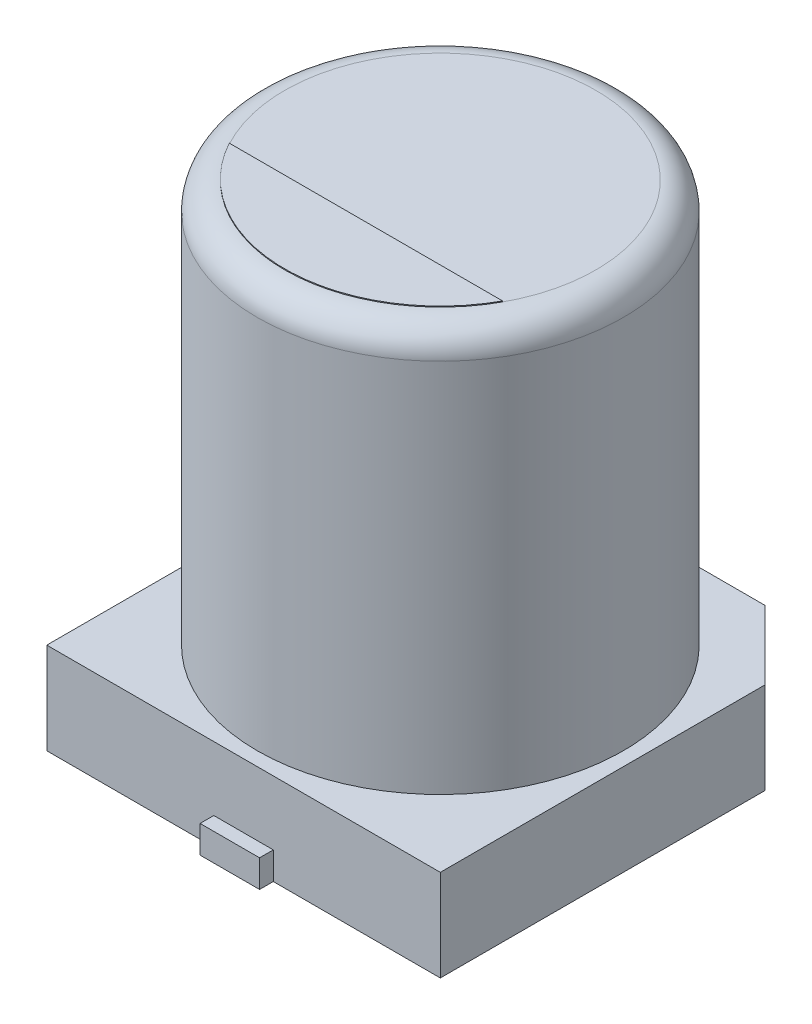
ISO-10303-21;
HEADER;
FILE_DESCRIPTION(('STEP AP214'),'2;1');
FILE_NAME('part.step','',(''),(''),'','','');
FILE_SCHEMA(('AUTOMOTIVE_DESIGN { 1 0 10303 214 1 1 1 1 }'));
ENDSEC;
DATA;
#1=APPLICATION_CONTEXT('core data for automotive mechanical design processes');
#2=APPLICATION_PROTOCOL_DEFINITION('international standard','automotive_design',2000,#1);
#3=PRODUCT_CONTEXT('',#1,'mechanical');
#4=PRODUCT('Part','Part','',(#3));
#5=PRODUCT_RELATED_PRODUCT_CATEGORY('part','',(#4));
#6=PRODUCT_DEFINITION_FORMATION('','',#4);
#7=PRODUCT_DEFINITION_CONTEXT('part definition',#1,'design');
#8=PRODUCT_DEFINITION('design','',#6,#7);
#9=PRODUCT_DEFINITION_SHAPE('','',#8);
#10=(LENGTH_UNIT() NAMED_UNIT(*) SI_UNIT(.MILLI.,.METRE.));
#11=(NAMED_UNIT(*) PLANE_ANGLE_UNIT() SI_UNIT($,.RADIAN.));
#12=(NAMED_UNIT(*) SI_UNIT($,.STERADIAN.) SOLID_ANGLE_UNIT());
#13=UNCERTAINTY_MEASURE_WITH_UNIT(LENGTH_MEASURE(1.E-05),#10,'distance_accuracy_value','');
#14=(GEOMETRIC_REPRESENTATION_CONTEXT(3) GLOBAL_UNCERTAINTY_ASSIGNED_CONTEXT((#13)) GLOBAL_UNIT_ASSIGNED_CONTEXT((#10,
#11,#12)) REPRESENTATION_CONTEXT('',''));
#15=CARTESIAN_POINT('',(0.,0.,0.));
#16=DIRECTION('',(0.,0.,1.));
#17=DIRECTION('',(1.,0.,0.));
#18=AXIS2_PLACEMENT_3D('',#15,#16,#17);
#19=CARTESIAN_POINT('',(0.,5.4,0.));
#20=DIRECTION('',(0.,1.,0.));
#21=DIRECTION('',(0.,0.,1.));
#22=AXIS2_PLACEMENT_3D('',#19,#20,#21);
#23=PLANE('',#22);
#24=CARTESIAN_POINT('',(0.,5.4,0.));
#25=DIRECTION('',(0.,1.,0.));
#26=DIRECTION('',(0.,0.,1.));
#27=AXIS2_PLACEMENT_3D('',#24,#25,#26);
#28=CIRCLE('',#27,1.7);
#29=CARTESIAN_POINT('',(1.49303756103946,5.4,0.812919947673408));
#30=VERTEX_POINT('',#29);
#31=CARTESIAN_POINT('',(-1.49303756103946,5.4,0.812919947673408));
#32=VERTEX_POINT('',#31);
#33=EDGE_CURVE('E221',#30,#32,#28,.T.);
#34=ORIENTED_EDGE('',*,*,#33,.T.);
#35=DIRECTION('',(-1.,0.,0.));
#36=VECTOR('',#35,1.);
#37=CARTESIAN_POINT('',(1.49303756103946,5.4,0.812919947673408));
#38=LINE('',#37,#36);
#39=EDGE_CURVE('E159',#30,#32,#38,.T.);
#40=ORIENTED_EDGE('',*,*,#39,.F.);
#41=EDGE_LOOP('',(#34,#40));
#42=FACE_BOUND('',#41,.T.);
#43=ADVANCED_FACE('F33',(#42),#23,.T.);
#44=CARTESIAN_POINT('',(-1.4,1.,-2.15));
#45=DIRECTION('',(0.,0.,1.));
#46=DIRECTION('',(1.,0.,0.));
#47=AXIS2_PLACEMENT_3D('',#44,#45,#46);
#48=PLANE('',#47);
#49=DIRECTION('',(0.,-1.,0.));
#50=VECTOR('',#49,1.);
#51=CARTESIAN_POINT('',(0.325,1.,-2.15));
#52=LINE('',#51,#50);
#53=CARTESIAN_POINT('',(0.325,0.3,-2.15));
#54=VERTEX_POINT('',#53);
#55=CARTESIAN_POINT('',(0.325,0.,-2.15));
#56=VERTEX_POINT('',#55);
#57=EDGE_CURVE('E188',#54,#56,#52,.T.);
#58=ORIENTED_EDGE('',*,*,#57,.F.);
#59=DIRECTION('',(-1.,0.,0.));
#60=VECTOR('',#59,1.);
#61=CARTESIAN_POINT('',(-1.4,0.3,-2.15));
#62=LINE('',#61,#60);
#63=CARTESIAN_POINT('',(-0.325,0.3,-2.15));
#64=VERTEX_POINT('',#63);
#65=EDGE_CURVE('E11',#54,#64,#62,.T.);
#66=ORIENTED_EDGE('',*,*,#65,.T.);
#67=DIRECTION('',(0.,1.,0.));
#68=VECTOR('',#67,1.);
#69=CARTESIAN_POINT('',(-0.325,1.,-2.15));
#70=LINE('',#69,#68);
#71=CARTESIAN_POINT('',(-0.325,0.,-2.15));
#72=VERTEX_POINT('',#71);
#73=EDGE_CURVE('E186',#72,#64,#70,.T.);
#74=ORIENTED_EDGE('',*,*,#73,.F.);
#75=DIRECTION('',(-1.,0.,0.));
#76=VECTOR('',#75,1.);
#77=CARTESIAN_POINT('',(-1.4,0.,-2.15));
#78=LINE('',#77,#76);
#79=CARTESIAN_POINT('',(-1.4,0.,-2.15));
#80=VERTEX_POINT('',#79);
#81=EDGE_CURVE('E242',#72,#80,#78,.T.);
#82=ORIENTED_EDGE('',*,*,#81,.T.);
#83=DIRECTION('',(0.,-1.,0.));
#84=VECTOR('',#83,1.);
#85=CARTESIAN_POINT('',(-1.4,1.,-2.15));
#86=LINE('',#85,#84);
#87=CARTESIAN_POINT('',(-1.4,1.,-2.15));
#88=VERTEX_POINT('',#87);
#89=EDGE_CURVE('E259',#88,#80,#86,.T.);
#90=ORIENTED_EDGE('',*,*,#89,.F.);
#91=DIRECTION('',(-1.,0.,0.));
#92=VECTOR('',#91,1.);
#93=CARTESIAN_POINT('',(-1.4,1.,-2.15));
#94=LINE('',#93,#92);
#95=CARTESIAN_POINT('',(1.4,1.,-2.15));
#96=VERTEX_POINT('',#95);
#97=EDGE_CURVE('E229',#96,#88,#94,.T.);
#98=ORIENTED_EDGE('',*,*,#97,.F.);
#99=DIRECTION('',(0.,-1.,0.));
#100=VECTOR('',#99,1.);
#101=CARTESIAN_POINT('',(1.4,1.,-2.15));
#102=LINE('',#101,#100);
#103=CARTESIAN_POINT('',(1.4,0.,-2.15));
#104=VERTEX_POINT('',#103);
#105=EDGE_CURVE('E262',#96,#104,#102,.T.);
#106=ORIENTED_EDGE('',*,*,#105,.T.);
#107=EDGE_CURVE('E243',#104,#56,#78,.T.);
#108=ORIENTED_EDGE('',*,*,#107,.T.);
#109=EDGE_LOOP('',(#58,#66,#74,#82,#90,#98,#106,#108));
#110=FACE_BOUND('',#109,.T.);
#111=ADVANCED_FACE('F319',(#110),#48,.F.);
#112=CARTESIAN_POINT('',(2.15,1.,2.15));
#113=DIRECTION('',(0.,0.,-1.));
#114=DIRECTION('',(-1.,0.,0.));
#115=AXIS2_PLACEMENT_3D('',#112,#113,#114);
#116=PLANE('',#115);
#117=DIRECTION('',(0.,-1.,0.));
#118=VECTOR('',#117,1.);
#119=CARTESIAN_POINT('',(-0.325,1.,2.15));
#120=LINE('',#119,#118);
#121=CARTESIAN_POINT('',(-0.325,0.3,2.15));
#122=VERTEX_POINT('',#121);
#123=CARTESIAN_POINT('',(-0.324999999999999,0.,2.15));
#124=VERTEX_POINT('',#123);
#125=EDGE_CURVE('E214',#122,#124,#120,.T.);
#126=ORIENTED_EDGE('',*,*,#125,.F.);
#127=DIRECTION('',(-1.,0.,0.));
#128=VECTOR('',#127,1.);
#129=CARTESIAN_POINT('',(2.15,0.3,2.15));
#130=LINE('',#129,#128);
#131=CARTESIAN_POINT('',(0.325,0.3,2.15));
#132=VERTEX_POINT('',#131);
#133=EDGE_CURVE('E41',#132,#122,#130,.T.);
#134=ORIENTED_EDGE('',*,*,#133,.F.);
#135=DIRECTION('',(0.,1.,0.));
#136=VECTOR('',#135,1.);
#137=CARTESIAN_POINT('',(0.325,1.,2.15));
#138=LINE('',#137,#136);
#139=CARTESIAN_POINT('',(0.325,0.,2.15));
#140=VERTEX_POINT('',#139);
#141=EDGE_CURVE('E211',#140,#132,#138,.T.);
#142=ORIENTED_EDGE('',*,*,#141,.F.);
#143=DIRECTION('',(1.,0.,0.));
#144=VECTOR('',#143,1.);
#145=CARTESIAN_POINT('',(2.15,0.,2.15));
#146=LINE('',#145,#144);
#147=CARTESIAN_POINT('',(2.15,0.,2.15));
#148=VERTEX_POINT('',#147);
#149=EDGE_CURVE('E249',#140,#148,#146,.T.);
#150=ORIENTED_EDGE('',*,*,#149,.T.);
#151=DIRECTION('',(0.,-1.,0.));
#152=VECTOR('',#151,1.);
#153=CARTESIAN_POINT('',(2.15,1.,2.15));
#154=LINE('',#153,#152);
#155=CARTESIAN_POINT('',(2.15,1.,2.15));
#156=VERTEX_POINT('',#155);
#157=EDGE_CURVE('E237',#156,#148,#154,.T.);
#158=ORIENTED_EDGE('',*,*,#157,.F.);
#159=DIRECTION('',(1.,0.,0.));
#160=VECTOR('',#159,1.);
#161=CARTESIAN_POINT('',(2.15,1.,2.15));
#162=LINE('',#161,#160);
#163=CARTESIAN_POINT('',(-2.15,1.,2.15));
#164=VERTEX_POINT('',#163);
#165=EDGE_CURVE('E235',#164,#156,#162,.T.);
#166=ORIENTED_EDGE('',*,*,#165,.F.);
#167=DIRECTION('',(0.,-1.,0.));
#168=VECTOR('',#167,1.);
#169=CARTESIAN_POINT('',(-2.15,1.,2.15));
#170=LINE('',#169,#168);
#171=CARTESIAN_POINT('',(-2.15,0.,2.15));
#172=VERTEX_POINT('',#171);
#173=EDGE_CURVE('E253',#164,#172,#170,.T.);
#174=ORIENTED_EDGE('',*,*,#173,.T.);
#175=EDGE_CURVE('E227',#172,#124,#146,.T.);
#176=ORIENTED_EDGE('',*,*,#175,.T.);
#177=EDGE_LOOP('',(#126,#134,#142,#150,#158,#166,#174,#176));
#178=FACE_BOUND('',#177,.T.);
#179=ADVANCED_FACE('F289',(#178),#116,.F.);
#180=CARTESIAN_POINT('',(2.15,1.,-1.4));
#181=DIRECTION('',(-1.,0.,0.));
#182=DIRECTION('',(0.,0.,1.));
#183=AXIS2_PLACEMENT_3D('',#180,#181,#182);
#184=PLANE('',#183);
#185=DIRECTION('',(0.,0.,-1.));
#186=VECTOR('',#185,1.);
#187=CARTESIAN_POINT('',(2.15,0.,-1.4));
#188=LINE('',#187,#186);
#189=CARTESIAN_POINT('',(2.15,0.,-1.4));
#190=VERTEX_POINT('',#189);
#191=EDGE_CURVE('E217',#148,#190,#188,.T.);
#192=ORIENTED_EDGE('',*,*,#191,.T.);
#193=DIRECTION('',(0.,-1.,0.));
#194=VECTOR('',#193,1.);
#195=CARTESIAN_POINT('',(2.15,1.,-1.4));
#196=LINE('',#195,#194);
#197=CARTESIAN_POINT('',(2.15,1.,-1.4));
#198=VERTEX_POINT('',#197);
#199=EDGE_CURVE('E222',#198,#190,#196,.T.);
#200=ORIENTED_EDGE('',*,*,#199,.F.);
#201=DIRECTION('',(0.,0.,-1.));
#202=VECTOR('',#201,1.);
#203=CARTESIAN_POINT('',(2.15,1.,-1.4));
#204=LINE('',#203,#202);
#205=EDGE_CURVE('E223',#156,#198,#204,.T.);
#206=ORIENTED_EDGE('',*,*,#205,.F.);
#207=ORIENTED_EDGE('',*,*,#157,.T.);
#208=EDGE_LOOP('',(#192,#200,#206,#207));
#209=FACE_BOUND('',#208,.T.);
#210=ADVANCED_FACE('F296',(#209),#184,.F.);
#211=CARTESIAN_POINT('',(1.4,1.,-2.15));
#212=DIRECTION('',(-0.707106781186547,0.,0.707106781186548));
#213=DIRECTION('',(0.707106781186548,0.,0.707106781186547));
#214=AXIS2_PLACEMENT_3D('',#211,#212,#213);
#215=PLANE('',#214);
#216=DIRECTION('',(-0.707106781186548,0.,-0.707106781186547));
#217=VECTOR('',#216,1.);
#218=CARTESIAN_POINT('',(1.4,0.,-2.15));
#219=LINE('',#218,#217);
#220=EDGE_CURVE('E240',#190,#104,#219,.T.);
#221=ORIENTED_EDGE('',*,*,#220,.T.);
#222=ORIENTED_EDGE('',*,*,#105,.F.);
#223=DIRECTION('',(-0.707106781186548,0.,-0.707106781186547));
#224=VECTOR('',#223,1.);
#225=CARTESIAN_POINT('',(1.4,1.,-2.15));
#226=LINE('',#225,#224);
#227=EDGE_CURVE('E226',#198,#96,#226,.T.);
#228=ORIENTED_EDGE('',*,*,#227,.F.);
#229=ORIENTED_EDGE('',*,*,#199,.T.);
#230=EDGE_LOOP('',(#221,#222,#228,#229));
#231=FACE_BOUND('',#230,.T.);
#232=ADVANCED_FACE('F303',(#231),#215,.F.);
#233=CARTESIAN_POINT('',(-2.15,1.,-1.4));
#234=DIRECTION('',(0.707106781186547,0.,0.707106781186548));
#235=DIRECTION('',(0.707106781186548,0.,-0.707106781186547));
#236=AXIS2_PLACEMENT_3D('',#233,#234,#235);
#237=PLANE('',#236);
#238=DIRECTION('',(-0.707106781186548,0.,0.707106781186547));
#239=VECTOR('',#238,1.);
#240=CARTESIAN_POINT('',(-2.15,0.,-1.4));
#241=LINE('',#240,#239);
#242=CARTESIAN_POINT('',(-2.15,0.,-1.4));
#243=VERTEX_POINT('',#242);
#244=EDGE_CURVE('E245',#80,#243,#241,.T.);
#245=ORIENTED_EDGE('',*,*,#244,.T.);
#246=DIRECTION('',(0.,-1.,0.));
#247=VECTOR('',#246,1.);
#248=CARTESIAN_POINT('',(-2.15,1.,-1.4));
#249=LINE('',#248,#247);
#250=CARTESIAN_POINT('',(-2.15,1.,-1.4));
#251=VERTEX_POINT('',#250);
#252=EDGE_CURVE('E256',#251,#243,#249,.T.);
#253=ORIENTED_EDGE('',*,*,#252,.F.);
#254=DIRECTION('',(-0.707106781186548,0.,0.707106781186547));
#255=VECTOR('',#254,1.);
#256=CARTESIAN_POINT('',(-2.15,1.,-1.4));
#257=LINE('',#256,#255);
#258=EDGE_CURVE('E231',#88,#251,#257,.T.);
#259=ORIENTED_EDGE('',*,*,#258,.F.);
#260=ORIENTED_EDGE('',*,*,#89,.T.);
#261=EDGE_LOOP('',(#245,#253,#259,#260));
#262=FACE_BOUND('',#261,.T.);
#263=ADVANCED_FACE('F317',(#262),#237,.F.);
#264=CARTESIAN_POINT('',(-2.15,1.,2.15));
#265=DIRECTION('',(1.,0.,0.));
#266=DIRECTION('',(0.,0.,-1.));
#267=AXIS2_PLACEMENT_3D('',#264,#265,#266);
#268=PLANE('',#267);
#269=DIRECTION('',(0.,0.,1.));
#270=VECTOR('',#269,1.);
#271=CARTESIAN_POINT('',(-2.15,0.,2.15));
#272=LINE('',#271,#270);
#273=EDGE_CURVE('E247',#243,#172,#272,.T.);
#274=ORIENTED_EDGE('',*,*,#273,.T.);
#275=ORIENTED_EDGE('',*,*,#173,.F.);
#276=DIRECTION('',(0.,0.,1.));
#277=VECTOR('',#276,1.);
#278=CARTESIAN_POINT('',(-2.15,1.,2.15));
#279=LINE('',#278,#277);
#280=EDGE_CURVE('E233',#251,#164,#279,.T.);
#281=ORIENTED_EDGE('',*,*,#280,.F.);
#282=ORIENTED_EDGE('',*,*,#252,.T.);
#283=EDGE_LOOP('',(#274,#275,#281,#282));
#284=FACE_BOUND('',#283,.T.);
#285=ADVANCED_FACE('F313',(#284),#268,.F.);
#286=CARTESIAN_POINT('',(0.,1.,0.));
#287=DIRECTION('',(0.,-1.,0.));
#288=DIRECTION('',(0.,0.,-1.));
#289=AXIS2_PLACEMENT_3D('',#286,#287,#288);
#290=PLANE('',#289);
#291=CARTESIAN_POINT('',(0.,1.,0.));
#292=DIRECTION('',(0.,-1.,0.));
#293=DIRECTION('',(0.,0.,-1.));
#294=AXIS2_PLACEMENT_3D('',#291,#292,#293);
#295=CIRCLE('',#294,2.);
#296=CARTESIAN_POINT('',(0.,1.,-2.));
#297=VERTEX_POINT('',#296);
#298=EDGE_CURVE('E218',#297,#297,#295,.F.);
#299=ORIENTED_EDGE('',*,*,#298,.F.);
#300=EDGE_LOOP('',(#299));
#301=FACE_BOUND('',#300,.T.);
#302=ORIENTED_EDGE('',*,*,#205,.T.);
#303=ORIENTED_EDGE('',*,*,#227,.T.);
#304=ORIENTED_EDGE('',*,*,#97,.T.);
#305=ORIENTED_EDGE('',*,*,#258,.T.);
#306=ORIENTED_EDGE('',*,*,#280,.T.);
#307=ORIENTED_EDGE('',*,*,#165,.T.);
#308=EDGE_LOOP('',(#302,#303,#304,#305,#306,#307));
#309=FACE_BOUND('',#308,.T.);
#310=ADVANCED_FACE('F306',(#301,#309),#290,.F.);
#311=CARTESIAN_POINT('',(0.,0.,0.));
#312=DIRECTION('',(0.,-1.,0.));
#313=DIRECTION('',(0.,0.,-1.));
#314=AXIS2_PLACEMENT_3D('',#311,#312,#313);
#315=PLANE('',#314);
#316=ORIENTED_EDGE('',*,*,#81,.F.);
#317=DIRECTION('',(0.,0.,1.));
#318=VECTOR('',#317,1.);
#319=CARTESIAN_POINT('',(-0.325,0.,-0.5));
#320=LINE('',#319,#318);
#321=CARTESIAN_POINT('',(-0.325,0.,-2.3));
#322=VERTEX_POINT('',#321);
#323=EDGE_CURVE('E172',#322,#72,#320,.T.);
#324=ORIENTED_EDGE('',*,*,#323,.F.);
#325=DIRECTION('',(-1.,0.,0.));
#326=VECTOR('',#325,1.);
#327=CARTESIAN_POINT('',(0.325,0.,-2.3));
#328=LINE('',#327,#326);
#329=CARTESIAN_POINT('',(0.325,0.,-2.3));
#330=VERTEX_POINT('',#329);
#331=EDGE_CURVE('E164',#330,#322,#328,.T.);
#332=ORIENTED_EDGE('',*,*,#331,.F.);
#333=DIRECTION('',(0.,0.,-1.));
#334=VECTOR('',#333,1.);
#335=CARTESIAN_POINT('',(0.325,0.,-0.5));
#336=LINE('',#335,#334);
#337=EDGE_CURVE('E162',#56,#330,#336,.T.);
#338=ORIENTED_EDGE('',*,*,#337,.F.);
#339=ORIENTED_EDGE('',*,*,#107,.F.);
#340=ORIENTED_EDGE('',*,*,#220,.F.);
#341=ORIENTED_EDGE('',*,*,#191,.F.);
#342=ORIENTED_EDGE('',*,*,#149,.F.);
#343=DIRECTION('',(0.,0.,-1.));
#344=VECTOR('',#343,1.);
#345=CARTESIAN_POINT('',(0.325,0.,0.5));
#346=LINE('',#345,#344);
#347=CARTESIAN_POINT('',(0.325,0.,2.3));
#348=VERTEX_POINT('',#347);
#349=EDGE_CURVE('E195',#348,#140,#346,.T.);
#350=ORIENTED_EDGE('',*,*,#349,.F.);
#351=DIRECTION('',(1.,0.,0.));
#352=VECTOR('',#351,1.);
#353=CARTESIAN_POINT('',(0.325,0.,2.3));
#354=LINE('',#353,#352);
#355=CARTESIAN_POINT('',(-0.325,0.,2.3));
#356=VERTEX_POINT('',#355);
#357=EDGE_CURVE('E202',#356,#348,#354,.T.);
#358=ORIENTED_EDGE('',*,*,#357,.F.);
#359=DIRECTION('',(0.,0.,1.));
#360=VECTOR('',#359,1.);
#361=CARTESIAN_POINT('',(-0.325,0.,0.5));
#362=LINE('',#361,#360);
#363=EDGE_CURVE('E191',#124,#356,#362,.T.);
#364=ORIENTED_EDGE('',*,*,#363,.F.);
#365=ORIENTED_EDGE('',*,*,#175,.F.);
#366=ORIENTED_EDGE('',*,*,#273,.F.);
#367=ORIENTED_EDGE('',*,*,#244,.F.);
#368=EDGE_LOOP('',(#316,#324,#332,#338,#339,#340,#341,#342,#350,#358,#364,#365,#366,#367));
#369=FACE_BOUND('',#368,.T.);
#370=ADVANCED_FACE('F298',(#369),#315,.T.);
#371=CARTESIAN_POINT('',(0.,5.4,0.));
#372=DIRECTION('',(0.,-1.,0.));
#373=DIRECTION('',(0.,0.,-1.));
#374=AXIS2_PLACEMENT_3D('',#371,#372,#373);
#375=CYLINDRICAL_SURFACE('',#374,2.);
#376=CARTESIAN_POINT('',(0.,5.1,0.));
#377=DIRECTION('',(0.,1.,0.));
#378=DIRECTION('',(0.,0.,1.));
#379=AXIS2_PLACEMENT_3D('',#376,#377,#378);
#380=CIRCLE('',#379,2.);
#381=CARTESIAN_POINT('',(0.,5.1,2.));
#382=VERTEX_POINT('',#381);
#383=EDGE_CURVE('E268',#382,#382,#380,.F.);
#384=ORIENTED_EDGE('',*,*,#383,.T.);
#385=EDGE_LOOP('',(#384));
#386=FACE_BOUND('',#385,.T.);
#387=ORIENTED_EDGE('',*,*,#298,.T.);
#388=EDGE_LOOP('',(#387));
#389=FACE_BOUND('',#388,.T.);
#390=ADVANCED_FACE('F354',(#386,#389),#375,.T.);
#391=CARTESIAN_POINT('',(0.,5.1,0.));
#392=DIRECTION('',(0.,1.,0.));
#393=DIRECTION('',(0.,0.,1.));
#394=AXIS2_PLACEMENT_3D('',#391,#392,#393);
#395=TOROIDAL_SURFACE('',#394,1.7,0.3);
#396=ORIENTED_EDGE('',*,*,#383,.F.);
#397=EDGE_LOOP('',(#396));
#398=FACE_BOUND('',#397,.T.);
#399=ORIENTED_EDGE('',*,*,#33,.F.);
#400=CARTESIAN_POINT('',(0.,5.4,0.));
#401=DIRECTION('',(0.,1.,0.));
#402=DIRECTION('',(0.,0.,-1.));
#403=AXIS2_PLACEMENT_3D('',#400,#401,#402);
#404=CIRCLE('',#403,1.7);
#405=EDGE_CURVE('E47',#32,#30,#404,.T.);
#406=ORIENTED_EDGE('',*,*,#405,.F.);
#407=EDGE_LOOP('',(#399,#406));
#408=FACE_BOUND('',#407,.T.);
#409=ADVANCED_FACE('F35',(#398,#408),#395,.T.);
#410=CARTESIAN_POINT('',(0.,0.3,0.));
#411=DIRECTION('',(0.,-1.,0.));
#412=DIRECTION('',(0.,0.,-1.));
#413=AXIS2_PLACEMENT_3D('',#410,#411,#412);
#414=PLANE('',#413);
#415=DIRECTION('',(0.,0.,-1.));
#416=VECTOR('',#415,1.);
#417=CARTESIAN_POINT('',(0.325,0.3,0.5));
#418=LINE('',#417,#416);
#419=CARTESIAN_POINT('',(0.325,0.3,2.3));
#420=VERTEX_POINT('',#419);
#421=EDGE_CURVE('E197',#420,#132,#418,.T.);
#422=ORIENTED_EDGE('',*,*,#421,.T.);
#423=ORIENTED_EDGE('',*,*,#133,.T.);
#424=DIRECTION('',(0.,0.,1.));
#425=VECTOR('',#424,1.);
#426=CARTESIAN_POINT('',(-0.325,0.3,0.5));
#427=LINE('',#426,#425);
#428=CARTESIAN_POINT('',(-0.325,0.3,2.3));
#429=VERTEX_POINT('',#428);
#430=EDGE_CURVE('E192',#122,#429,#427,.T.);
#431=ORIENTED_EDGE('',*,*,#430,.T.);
#432=DIRECTION('',(1.,0.,0.));
#433=VECTOR('',#432,1.);
#434=CARTESIAN_POINT('',(0.325,0.3,2.3));
#435=LINE('',#434,#433);
#436=EDGE_CURVE('E194',#429,#420,#435,.T.);
#437=ORIENTED_EDGE('',*,*,#436,.T.);
#438=EDGE_LOOP('',(#422,#423,#431,#437));
#439=FACE_BOUND('',#438,.T.);
#440=ADVANCED_FACE('F273',(#439),#414,.F.);
#441=CARTESIAN_POINT('',(-0.325,0.3,0.5));
#442=DIRECTION('',(1.,0.,0.));
#443=DIRECTION('',(0.,0.,-1.));
#444=AXIS2_PLACEMENT_3D('',#441,#442,#443);
#445=PLANE('',#444);
#446=ORIENTED_EDGE('',*,*,#430,.F.);
#447=ORIENTED_EDGE('',*,*,#125,.T.);
#448=ORIENTED_EDGE('',*,*,#363,.T.);
#449=DIRECTION('',(0.,-1.,0.));
#450=VECTOR('',#449,1.);
#451=CARTESIAN_POINT('',(-0.325,0.3,2.3));
#452=LINE('',#451,#450);
#453=EDGE_CURVE('E208',#429,#356,#452,.T.);
#454=ORIENTED_EDGE('',*,*,#453,.F.);
#455=EDGE_LOOP('',(#446,#447,#448,#454));
#456=FACE_BOUND('',#455,.T.);
#457=ADVANCED_FACE('F280',(#456),#445,.F.);
#458=CARTESIAN_POINT('',(0.325,0.3,0.5));
#459=DIRECTION('',(-1.,0.,0.));
#460=DIRECTION('',(0.,0.,1.));
#461=AXIS2_PLACEMENT_3D('',#458,#459,#460);
#462=PLANE('',#461);
#463=ORIENTED_EDGE('',*,*,#349,.T.);
#464=ORIENTED_EDGE('',*,*,#141,.T.);
#465=ORIENTED_EDGE('',*,*,#421,.F.);
#466=DIRECTION('',(0.,-1.,0.));
#467=VECTOR('',#466,1.);
#468=CARTESIAN_POINT('',(0.325,0.3,2.3));
#469=LINE('',#468,#467);
#470=EDGE_CURVE('E200',#420,#348,#469,.T.);
#471=ORIENTED_EDGE('',*,*,#470,.T.);
#472=EDGE_LOOP('',(#463,#464,#465,#471));
#473=FACE_BOUND('',#472,.T.);
#474=ADVANCED_FACE('F288',(#473),#462,.F.);
#475=CARTESIAN_POINT('',(0.325,0.3,2.3));
#476=DIRECTION('',(0.,0.,-1.));
#477=DIRECTION('',(-1.,0.,0.));
#478=AXIS2_PLACEMENT_3D('',#475,#476,#477);
#479=PLANE('',#478);
#480=ORIENTED_EDGE('',*,*,#357,.T.);
#481=ORIENTED_EDGE('',*,*,#470,.F.);
#482=ORIENTED_EDGE('',*,*,#436,.F.);
#483=ORIENTED_EDGE('',*,*,#453,.T.);
#484=EDGE_LOOP('',(#480,#481,#482,#483));
#485=FACE_BOUND('',#484,.T.);
#486=ADVANCED_FACE('F284',(#485),#479,.F.);
#487=CARTESIAN_POINT('',(0.,0.3,0.));
#488=DIRECTION('',(0.,1.,0.));
#489=DIRECTION('',(0.,0.,1.));
#490=AXIS2_PLACEMENT_3D('',#487,#488,#489);
#491=PLANE('',#490);
#492=ORIENTED_EDGE('',*,*,#65,.F.);
#493=DIRECTION('',(0.,0.,-1.));
#494=VECTOR('',#493,1.);
#495=CARTESIAN_POINT('',(0.325,0.3,-0.5));
#496=LINE('',#495,#494);
#497=CARTESIAN_POINT('',(0.325,0.3,-2.3));
#498=VERTEX_POINT('',#497);
#499=EDGE_CURVE('E169',#54,#498,#496,.T.);
#500=ORIENTED_EDGE('',*,*,#499,.T.);
#501=DIRECTION('',(-1.,0.,0.));
#502=VECTOR('',#501,1.);
#503=CARTESIAN_POINT('',(0.325,0.3,-2.3));
#504=LINE('',#503,#502);
#505=CARTESIAN_POINT('',(-0.325,0.3,-2.3));
#506=VERTEX_POINT('',#505);
#507=EDGE_CURVE('E171',#498,#506,#504,.T.);
#508=ORIENTED_EDGE('',*,*,#507,.T.);
#509=DIRECTION('',(0.,0.,1.));
#510=VECTOR('',#509,1.);
#511=CARTESIAN_POINT('',(-0.325,0.3,-0.5));
#512=LINE('',#511,#510);
#513=EDGE_CURVE('E174',#506,#64,#512,.T.);
#514=ORIENTED_EDGE('',*,*,#513,.T.);
#515=EDGE_LOOP('',(#492,#500,#508,#514));
#516=FACE_BOUND('',#515,.T.);
#517=ADVANCED_FACE('F334',(#516),#491,.T.);
#518=CARTESIAN_POINT('',(0.325,0.3,-0.5));
#519=DIRECTION('',(-1.,0.,0.));
#520=DIRECTION('',(0.,0.,1.));
#521=AXIS2_PLACEMENT_3D('',#518,#519,#520);
#522=PLANE('',#521);
#523=ORIENTED_EDGE('',*,*,#499,.F.);
#524=ORIENTED_EDGE('',*,*,#57,.T.);
#525=ORIENTED_EDGE('',*,*,#337,.T.);
#526=DIRECTION('',(0.,-1.,0.));
#527=VECTOR('',#526,1.);
#528=CARTESIAN_POINT('',(0.325,0.3,-2.3));
#529=LINE('',#528,#527);
#530=EDGE_CURVE('E183',#498,#330,#529,.T.);
#531=ORIENTED_EDGE('',*,*,#530,.F.);
#532=EDGE_LOOP('',(#523,#524,#525,#531));
#533=FACE_BOUND('',#532,.T.);
#534=ADVANCED_FACE('F332',(#533),#522,.F.);
#535=CARTESIAN_POINT('',(-0.325,0.3,-0.5));
#536=DIRECTION('',(1.,0.,0.));
#537=DIRECTION('',(0.,0.,-1.));
#538=AXIS2_PLACEMENT_3D('',#535,#536,#537);
#539=PLANE('',#538);
#540=ORIENTED_EDGE('',*,*,#323,.T.);
#541=ORIENTED_EDGE('',*,*,#73,.T.);
#542=ORIENTED_EDGE('',*,*,#513,.F.);
#543=DIRECTION('',(0.,-1.,0.));
#544=VECTOR('',#543,1.);
#545=CARTESIAN_POINT('',(-0.325,0.3,-2.3));
#546=LINE('',#545,#544);
#547=EDGE_CURVE('E176',#506,#322,#546,.T.);
#548=ORIENTED_EDGE('',*,*,#547,.T.);
#549=EDGE_LOOP('',(#540,#541,#542,#548));
#550=FACE_BOUND('',#549,.T.);
#551=ADVANCED_FACE('F323',(#550),#539,.F.);
#552=CARTESIAN_POINT('',(0.325,0.3,-2.3));
#553=DIRECTION('',(0.,0.,1.));
#554=DIRECTION('',(1.,0.,0.));
#555=AXIS2_PLACEMENT_3D('',#552,#553,#554);
#556=PLANE('',#555);
#557=ORIENTED_EDGE('',*,*,#331,.T.);
#558=ORIENTED_EDGE('',*,*,#547,.F.);
#559=ORIENTED_EDGE('',*,*,#507,.F.);
#560=ORIENTED_EDGE('',*,*,#530,.T.);
#561=EDGE_LOOP('',(#557,#558,#559,#560));
#562=FACE_BOUND('',#561,.T.);
#563=ADVANCED_FACE('F328',(#562),#556,.F.);
#564=CARTESIAN_POINT('',(0.,5.41,0.));
#565=DIRECTION('',(0.,-1.,0.));
#566=DIRECTION('',(0.,0.,-1.));
#567=AXIS2_PLACEMENT_3D('',#564,#565,#566);
#568=CYLINDRICAL_SURFACE('',#567,1.7);
#569=ORIENTED_EDGE('',*,*,#405,.T.);
#570=DIRECTION('',(0.,-1.,0.));
#571=VECTOR('',#570,1.);
#572=CARTESIAN_POINT('',(1.49303756103946,5.41,0.812919947673408));
#573=LINE('',#572,#571);
#574=CARTESIAN_POINT('',(1.49303756103946,5.41,0.812919947673408));
#575=VERTEX_POINT('',#574);
#576=EDGE_CURVE('E150',#575,#30,#573,.T.);
#577=ORIENTED_EDGE('',*,*,#576,.F.);
#578=CARTESIAN_POINT('',(0.,5.41,0.));
#579=DIRECTION('',(0.,1.,0.));
#580=DIRECTION('',(0.,0.,-1.));
#581=AXIS2_PLACEMENT_3D('',#578,#579,#580);
#582=CIRCLE('',#581,1.7);
#583=CARTESIAN_POINT('',(-1.49303756103946,5.41,0.812919947673408));
#584=VERTEX_POINT('',#583);
#585=EDGE_CURVE('E155',#584,#575,#582,.T.);
#586=ORIENTED_EDGE('',*,*,#585,.F.);
#587=DIRECTION('',(0.,-1.,0.));
#588=VECTOR('',#587,1.);
#589=CARTESIAN_POINT('',(-1.49303756103946,5.41,0.812919947673408));
#590=LINE('',#589,#588);
#591=EDGE_CURVE('E152',#584,#32,#590,.T.);
#592=ORIENTED_EDGE('',*,*,#591,.T.);
#593=EDGE_LOOP('',(#569,#577,#586,#592));
#594=FACE_BOUND('',#593,.T.);
#595=ADVANCED_FACE('F161',(#594),#568,.T.);
#596=CARTESIAN_POINT('',(1.49303756103946,5.41,0.812919947673408));
#597=DIRECTION('',(0.,0.,1.));
#598=DIRECTION('',(1.,0.,0.));
#599=AXIS2_PLACEMENT_3D('',#596,#597,#598);
#600=PLANE('',#599);
#601=ORIENTED_EDGE('',*,*,#39,.T.);
#602=ORIENTED_EDGE('',*,*,#591,.F.);
#603=DIRECTION('',(-1.,0.,0.));
#604=VECTOR('',#603,1.);
#605=CARTESIAN_POINT('',(1.49303756103946,5.41,0.812919947673408));
#606=LINE('',#605,#604);
#607=EDGE_CURVE('E145',#575,#584,#606,.T.);
#608=ORIENTED_EDGE('',*,*,#607,.F.);
#609=ORIENTED_EDGE('',*,*,#576,.T.);
#610=EDGE_LOOP('',(#601,#602,#608,#609));
#611=FACE_BOUND('',#610,.T.);
#612=ADVANCED_FACE('F148',(#611),#600,.F.);
#613=CARTESIAN_POINT('',(0.,5.41,0.));
#614=DIRECTION('',(0.,-1.,0.));
#615=DIRECTION('',(0.,0.,-1.));
#616=AXIS2_PLACEMENT_3D('',#613,#614,#615);
#617=PLANE('',#616);
#618=ORIENTED_EDGE('',*,*,#585,.T.);
#619=ORIENTED_EDGE('',*,*,#607,.T.);
#620=EDGE_LOOP('',(#618,#619));
#621=FACE_BOUND('',#620,.T.);
#622=ADVANCED_FACE('F157',(#621),#617,.F.);
#623=CLOSED_SHELL('',(#43,#111,#179,#210,#232,#263,#285,#310,#370,#390,#409,#440,#457,#474,#486,
#517,#534,#551,#563,#595,#612,#622));
#624=MANIFOLD_SOLID_BREP('B2',#623);
#625=ADVANCED_BREP_SHAPE_REPRESENTATION('',(#18,#624),#14);
#626=SHAPE_DEFINITION_REPRESENTATION(#9,#625);
ENDSEC;
END-ISO-10303-21;
